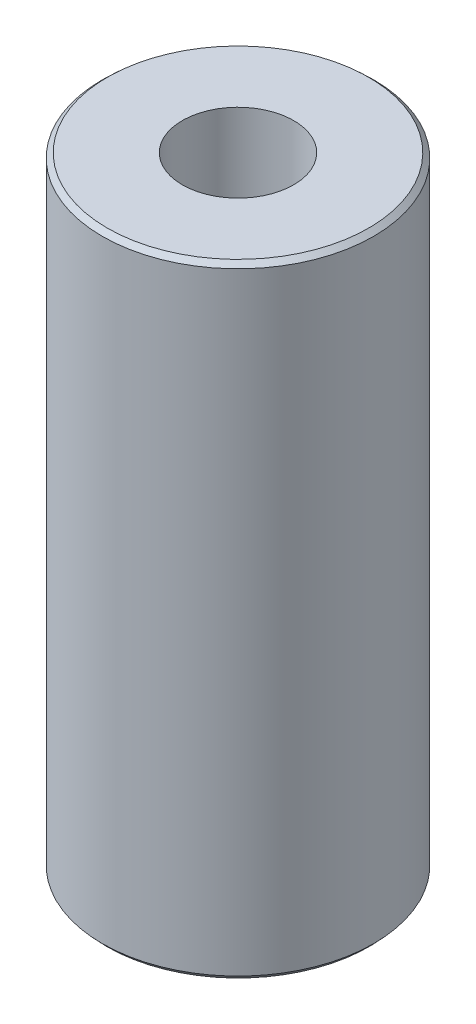
ISO-10303-21;
HEADER;
FILE_DESCRIPTION(('STEP AP214'),'2;1');
FILE_NAME('part.step','',(''),(''),'','','');
FILE_SCHEMA(('AUTOMOTIVE_DESIGN { 1 0 10303 214 1 1 1 1 }'));
ENDSEC;
DATA;
#1=APPLICATION_CONTEXT('core data for automotive mechanical design processes');
#2=APPLICATION_PROTOCOL_DEFINITION('international standard','automotive_design',2000,#1);
#3=PRODUCT_CONTEXT('',#1,'mechanical');
#4=PRODUCT('Part','Part','',(#3));
#5=PRODUCT_RELATED_PRODUCT_CATEGORY('part','',(#4));
#6=PRODUCT_DEFINITION_FORMATION('','',#4);
#7=PRODUCT_DEFINITION_CONTEXT('part definition',#1,'design');
#8=PRODUCT_DEFINITION('design','',#6,#7);
#9=PRODUCT_DEFINITION_SHAPE('','',#8);
#10=(LENGTH_UNIT() NAMED_UNIT(*) SI_UNIT(.MILLI.,.METRE.));
#11=(NAMED_UNIT(*) PLANE_ANGLE_UNIT() SI_UNIT($,.RADIAN.));
#12=(NAMED_UNIT(*) SI_UNIT($,.STERADIAN.) SOLID_ANGLE_UNIT());
#13=UNCERTAINTY_MEASURE_WITH_UNIT(LENGTH_MEASURE(1.E-05),#10,'distance_accuracy_value','');
#14=(GEOMETRIC_REPRESENTATION_CONTEXT(3) GLOBAL_UNCERTAINTY_ASSIGNED_CONTEXT((#13)) GLOBAL_UNIT_ASSIGNED_CONTEXT((#10,
#11,#12)) REPRESENTATION_CONTEXT('',''));
#15=CARTESIAN_POINT('',(0.,0.,0.));
#16=DIRECTION('',(0.,0.,1.));
#17=DIRECTION('',(1.,0.,0.));
#18=AXIS2_PLACEMENT_3D('',#15,#16,#17);
#19=CARTESIAN_POINT('',(0.,229.325047442877,0.));
#20=DIRECTION('',(0.,-1.,0.));
#21=DIRECTION('',(0.,0.,-1.));
#22=AXIS2_PLACEMENT_3D('',#19,#20,#21);
#23=CYLINDRICAL_SURFACE('',#22,50.);
#24=CARTESIAN_POINT('',(0.,227.613472778522,0.));
#25=DIRECTION('',(0.,1.,0.));
#26=DIRECTION('',(0.,0.,1.));
#27=AXIS2_PLACEMENT_3D('',#24,#25,#26);
#28=CIRCLE('',#27,50.);
#29=CARTESIAN_POINT('',(0.,227.613472778522,50.));
#30=VERTEX_POINT('',#29);
#31=EDGE_CURVE('E50',#30,#30,#28,.F.);
#32=ORIENTED_EDGE('',*,*,#31,.T.);
#33=EDGE_LOOP('',(#32));
#34=FACE_BOUND('',#33,.T.);
#35=CARTESIAN_POINT('',(0.,1.83440256363218,0.));
#36=DIRECTION('',(0.,1.,0.));
#37=DIRECTION('',(0.,0.,1.));
#38=AXIS2_PLACEMENT_3D('',#35,#36,#37);
#39=CIRCLE('',#38,50.);
#40=CARTESIAN_POINT('',(0.,1.83440256363218,50.));
#41=VERTEX_POINT('',#40);
#42=EDGE_CURVE('E51',#41,#41,#39,.T.);
#43=ORIENTED_EDGE('',*,*,#42,.T.);
#44=EDGE_LOOP('',(#43));
#45=FACE_BOUND('',#44,.T.);
#46=ADVANCED_FACE('F39',(#34,#45),#23,.T.);
#47=CARTESIAN_POINT('',(0.,229.325047442877,0.));
#48=DIRECTION('',(0.,1.,0.));
#49=DIRECTION('',(0.,0.,1.));
#50=AXIS2_PLACEMENT_3D('',#47,#48,#49);
#51=PLANE('',#50);
#52=CARTESIAN_POINT('',(0.,229.325047442877,0.));
#53=DIRECTION('',(0.,1.,0.));
#54=DIRECTION('',(0.,0.,1.));
#55=AXIS2_PLACEMENT_3D('',#52,#53,#54);
#56=CIRCLE('',#55,48.1655974363679);
#57=CARTESIAN_POINT('',(0.,229.325047442877,48.1655974363679));
#58=VERTEX_POINT('',#57);
#59=EDGE_CURVE('E54',#58,#58,#56,.T.);
#60=ORIENTED_EDGE('',*,*,#59,.T.);
#61=EDGE_LOOP('',(#60));
#62=FACE_BOUND('',#61,.T.);
#63=CARTESIAN_POINT('',(0.,229.325047442877,0.));
#64=DIRECTION('',(0.,1.,0.));
#65=DIRECTION('',(0.,0.,1.));
#66=AXIS2_PLACEMENT_3D('',#63,#64,#65);
#67=CIRCLE('',#66,20.5275077618773);
#68=CARTESIAN_POINT('',(0.,229.325047442877,20.5275077618773));
#69=VERTEX_POINT('',#68);
#70=EDGE_CURVE('E58',#69,#69,#67,.T.);
#71=ORIENTED_EDGE('',*,*,#70,.F.);
#72=EDGE_LOOP('',(#71));
#73=FACE_BOUND('',#72,.T.);
#74=ADVANCED_FACE('F69',(#62,#73),#51,.T.);
#75=CARTESIAN_POINT('',(0.,0.,0.));
#76=DIRECTION('',(0.,1.,0.));
#77=DIRECTION('',(0.,0.,1.));
#78=AXIS2_PLACEMENT_3D('',#75,#76,#77);
#79=PLANE('',#78);
#80=CARTESIAN_POINT('',(0.,0.,0.));
#81=DIRECTION('',(0.,1.,0.));
#82=DIRECTION('',(0.,0.,1.));
#83=AXIS2_PLACEMENT_3D('',#80,#81,#82);
#84=CIRCLE('',#83,48.2884253356448);
#85=CARTESIAN_POINT('',(0.,0.,48.2884253356448));
#86=VERTEX_POINT('',#85);
#87=EDGE_CURVE('E10',#86,#86,#84,.F.);
#88=ORIENTED_EDGE('',*,*,#87,.T.);
#89=EDGE_LOOP('',(#88));
#90=FACE_BOUND('',#89,.T.);
#91=CARTESIAN_POINT('',(0.,0.,0.));
#92=DIRECTION('',(0.,1.,0.));
#93=DIRECTION('',(0.,0.,1.));
#94=AXIS2_PLACEMENT_3D('',#91,#92,#93);
#95=CIRCLE('',#94,20.5275077618773);
#96=CARTESIAN_POINT('',(0.,0.,20.5275077618773));
#97=VERTEX_POINT('',#96);
#98=EDGE_CURVE('E63',#97,#97,#95,.T.);
#99=ORIENTED_EDGE('',*,*,#98,.T.);
#100=EDGE_LOOP('',(#99));
#101=FACE_BOUND('',#100,.T.);
#102=ADVANCED_FACE('F75',(#90,#101),#79,.F.);
#103=CARTESIAN_POINT('',(0.,229.325047442877,0.));
#104=DIRECTION('',(0.,-1.,0.));
#105=DIRECTION('',(0.,0.,-1.));
#106=AXIS2_PLACEMENT_3D('',#103,#104,#105);
#107=CYLINDRICAL_SURFACE('',#106,20.5275077618773);
#108=ORIENTED_EDGE('',*,*,#70,.T.);
#109=EDGE_LOOP('',(#108));
#110=FACE_BOUND('',#109,.T.);
#111=ORIENTED_EDGE('',*,*,#98,.F.);
#112=EDGE_LOOP('',(#111));
#113=FACE_BOUND('',#112,.T.);
#114=ADVANCED_FACE('F70',(#110,#113),#107,.F.);
#115=CARTESIAN_POINT('',(0.,229.325047442877,0.));
#116=DIRECTION('',(0.,-1.,0.));
#117=DIRECTION('',(0.,0.,-1.));
#118=AXIS2_PLACEMENT_3D('',#115,#116,#117);
#119=CONICAL_SURFACE('',#118,48.1655974363679,0.820022979700875);
#120=ORIENTED_EDGE('',*,*,#31,.F.);
#121=EDGE_LOOP('',(#120));
#122=FACE_BOUND('',#121,.T.);
#123=ORIENTED_EDGE('',*,*,#59,.F.);
#124=EDGE_LOOP('',(#123));
#125=FACE_BOUND('',#124,.T.);
#126=ADVANCED_FACE('F81',(#122,#125),#119,.T.);
#127=CARTESIAN_POINT('',(0.,1.83440256363218,0.));
#128=DIRECTION('',(0.,1.,0.));
#129=DIRECTION('',(0.,0.,1.));
#130=AXIS2_PLACEMENT_3D('',#127,#128,#129);
#131=CONICAL_SURFACE('',#130,50.,0.750773347094023);
#132=ORIENTED_EDGE('',*,*,#87,.F.);
#133=EDGE_LOOP('',(#132));
#134=FACE_BOUND('',#133,.T.);
#135=ORIENTED_EDGE('',*,*,#42,.F.);
#136=EDGE_LOOP('',(#135));
#137=FACE_BOUND('',#136,.T.);
#138=ADVANCED_FACE('F45',(#134,#137),#131,.T.);
#139=CLOSED_SHELL('',(#46,#74,#102,#114,#126,#138));
#140=MANIFOLD_SOLID_BREP('B2',#139);
#141=ADVANCED_BREP_SHAPE_REPRESENTATION('',(#18,#140),#14);
#142=SHAPE_DEFINITION_REPRESENTATION(#9,#141);
ENDSEC;
END-ISO-10303-21;
